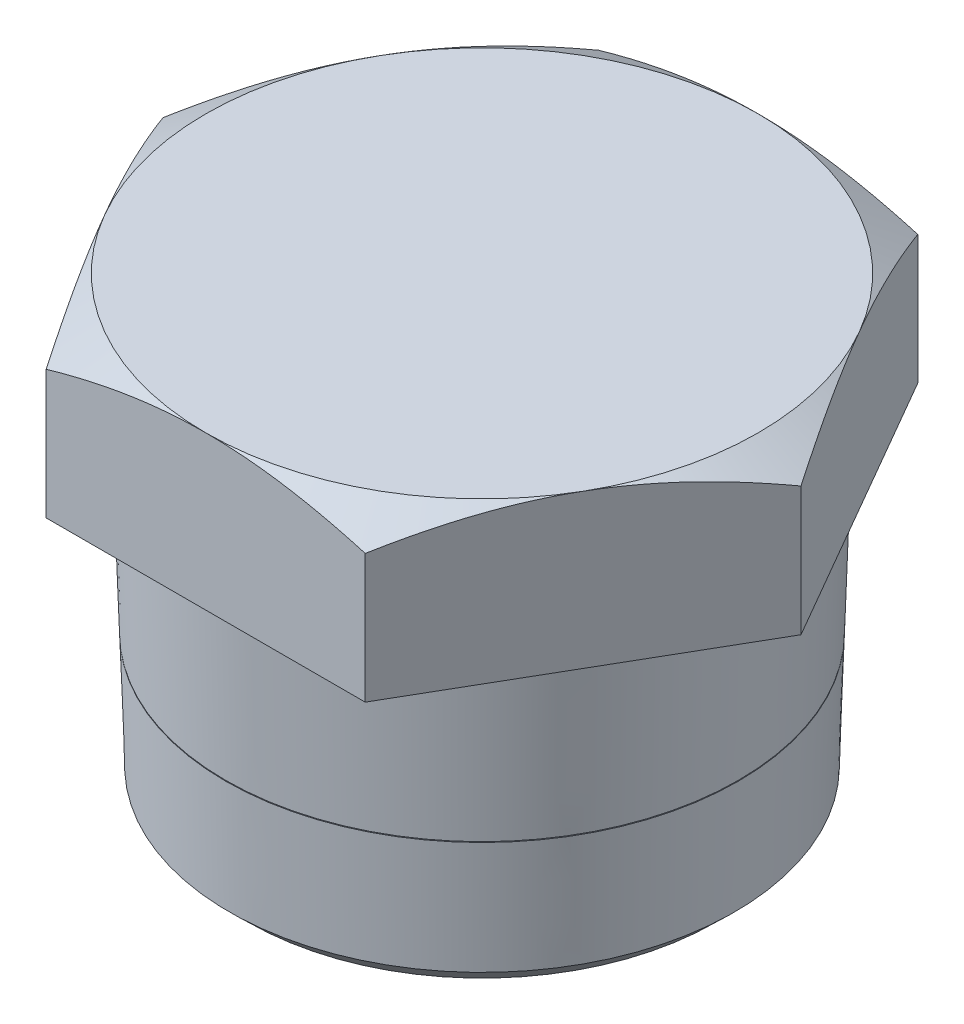
ISO-10303-21;
HEADER;
FILE_DESCRIPTION(('STEP AP214'),'2;1');
FILE_NAME('part.step','',(''),(''),'','','');
FILE_SCHEMA(('AUTOMOTIVE_DESIGN { 1 0 10303 214 1 1 1 1 }'));
ENDSEC;
DATA;
#1=APPLICATION_CONTEXT('core data for automotive mechanical design processes');
#2=APPLICATION_PROTOCOL_DEFINITION('international standard','automotive_design',2000,#1);
#3=PRODUCT_CONTEXT('',#1,'mechanical');
#4=PRODUCT('Part','Part','',(#3));
#5=PRODUCT_RELATED_PRODUCT_CATEGORY('part','',(#4));
#6=PRODUCT_DEFINITION_FORMATION('','',#4);
#7=PRODUCT_DEFINITION_CONTEXT('part definition',#1,'design');
#8=PRODUCT_DEFINITION('design','',#6,#7);
#9=PRODUCT_DEFINITION_SHAPE('','',#8);
#10=(LENGTH_UNIT() NAMED_UNIT(*) SI_UNIT(.MILLI.,.METRE.));
#11=(NAMED_UNIT(*) PLANE_ANGLE_UNIT() SI_UNIT($,.RADIAN.));
#12=(NAMED_UNIT(*) SI_UNIT($,.STERADIAN.) SOLID_ANGLE_UNIT());
#13=UNCERTAINTY_MEASURE_WITH_UNIT(LENGTH_MEASURE(1.E-05),#10,'distance_accuracy_value','');
#14=(GEOMETRIC_REPRESENTATION_CONTEXT(3) GLOBAL_UNCERTAINTY_ASSIGNED_CONTEXT((#13)) GLOBAL_UNIT_ASSIGNED_CONTEXT((#10,
#11,#12)) REPRESENTATION_CONTEXT('',''));
#15=CARTESIAN_POINT('',(0.,0.,0.));
#16=DIRECTION('',(0.,0.,1.));
#17=DIRECTION('',(1.,0.,0.));
#18=AXIS2_PLACEMENT_3D('',#15,#16,#17);
#19=CARTESIAN_POINT('',(0.,8.38919274896095,0.));
#20=DIRECTION('',(0.,-1.,0.));
#21=DIRECTION('',(0.,0.,-1.));
#22=AXIS2_PLACEMENT_3D('',#19,#20,#21);
#23=CONICAL_SURFACE('',#22,20.79,1.0471975511966);
#24=CARTESIAN_POINT('',(0.,10.,0.));
#25=DIRECTION('',(0.,-1.,0.));
#26=DIRECTION('',(0.,0.,-1.));
#27=AXIS2_PLACEMENT_3D('',#24,#25,#26);
#28=CIRCLE('',#27,18.);
#29=CARTESIAN_POINT('',(15.5884572681199,10.,-9.));
#30=VERTEX_POINT('',#29);
#31=CARTESIAN_POINT('',(15.5884572681199,10.,9.));
#32=VERTEX_POINT('',#31);
#33=EDGE_CURVE('E248',#30,#32,#28,.T.);
#34=ORIENTED_EDGE('',*,*,#33,.T.);
#35=CARTESIAN_POINT('',(10.3923036907127,8.39230417874654,18.000002));
#36=CARTESIAN_POINT('',(10.6207213092251,8.52416990531842,17.6043710793927));
#37=CARTESIAN_POINT('',(10.8500298784013,8.65005158318754,17.2071969869686));
#38=CARTESIAN_POINT('',(11.3104857871325,8.88818352120919,16.4096639584007));
#39=CARTESIAN_POINT('',(11.5416337049718,9.00042929803447,16.0093040206394));
#40=CARTESIAN_POINT('',(12.0062150050465,9.20978057800742,15.2046256046637));
#41=CARTESIAN_POINT('',(12.2396524525244,9.30685025984467,14.8003000852426));
#42=CARTESIAN_POINT('',(12.70814936062,9.48376493806821,13.9888396372322));
#43=CARTESIAN_POINT('',(12.9432087275495,9.56361092090378,13.5817048709152));
#44=CARTESIAN_POINT('',(13.4089265715698,9.7026821530429,12.7750579030806));
#45=CARTESIAN_POINT('',(13.6395504758277,9.76236771446473,12.3756055834662));
#46=CARTESIAN_POINT('',(14.1018549809195,9.86244605309504,11.5748706920792));
#47=CARTESIAN_POINT('',(14.3335356020085,9.90283845891142,11.1735880852239));
#48=CARTESIAN_POINT('',(14.7972859753715,9.9633106043179,10.3703488765302));
#49=CARTESIAN_POINT('',(15.029354935494,9.98341448032252,9.96839364673834));
#50=CARTESIAN_POINT('',(15.4937069998071,10.0028772264915,9.16411227874859));
#51=CARTESIAN_POINT('',(15.7259900971578,10.0022367377687,8.76178615239763));
#52=CARTESIAN_POINT('',(16.1602412290879,9.98166030105865,8.00964112865039));
#53=CARTESIAN_POINT('',(16.3622402189068,9.9642334647632,7.65976861520657));
#54=CARTESIAN_POINT('',(16.7657563433001,9.91402245272442,6.96085818608392));
#55=CARTESIAN_POINT('',(16.9672734847368,9.88123849701044,6.61182025851956));
#56=CARTESIAN_POINT('',(17.3697495660109,9.80088205841273,5.91471123692161));
#57=CARTESIAN_POINT('',(17.5707078347023,9.75329620398764,5.56664130534709));
#58=CARTESIAN_POINT('',(17.9716677608277,9.64417559945913,4.87215834149869));
#59=CARTESIAN_POINT('',(18.1716694223098,9.58264090843477,4.52574530221355));
#60=CARTESIAN_POINT('',(18.7787998249196,9.37554862611313,3.47416459807364));
#61=CARTESIAN_POINT('',(19.1841704624113,9.20934206451339,2.77204205804138));
#62=CARTESIAN_POINT('',(19.9888675791619,8.83212237906111,1.37826576712528));
#63=CARTESIAN_POINT('',(20.3882043591908,8.6211978318564,0.686594174784224));
#64=CARTESIAN_POINT('',(20.784610845527,8.39230417874654,-1.99999999899727E-06));
#65=B_SPLINE_CURVE_WITH_KNOTS('',3,(#35,#36,#37,#38,#39,#40,#41,#42,#43,#44,#45,#46,#47,#48,#49,
#50,#51,#52,#53,#54,#55,#56,#57,#58,#59,#60,#61,#62,#63,#64),.UNSPECIFIED.,.F.,.F.,(4,2,2,2,2,2,
2,2,2,2,2,2,2,2,4),(0.,1.42649553586316,2.85345882489467,4.28374102583886,5.71394128876975,
7.1088419116791,8.50376938526055,9.89703540880222,11.290258372938,12.5030869860494,
13.7158982228735,14.9298082704652,16.1437131767438,18.6249911150355,21.1013993466681),.UNSPECIFIED.);
#66=CARTESIAN_POINT('',(20.7846096908266,8.39230484541327,0.));
#67=VERTEX_POINT('',#66);
#68=EDGE_CURVE('E54',#32,#67,#65,.T.);
#69=ORIENTED_EDGE('',*,*,#68,.T.);
#70=CARTESIAN_POINT('',(20.784610845527,8.39230417874654,2.00000000181156E-06));
#71=CARTESIAN_POINT('',(20.5561932270147,8.52416990531841,-0.39562892060731));
#72=CARTESIAN_POINT('',(20.3268846578385,8.65005158318753,-0.792803013031403));
#73=CARTESIAN_POINT('',(19.8664287491073,8.88818352120917,-1.59033604159927));
#74=CARTESIAN_POINT('',(19.635280831268,9.00042929803445,-1.9906959793606));
#75=CARTESIAN_POINT('',(19.1706995311933,9.2097805780074,-2.79537439533634));
#76=CARTESIAN_POINT('',(18.9372620837153,9.30685025984465,-3.1996999147574));
#77=CARTESIAN_POINT('',(18.4687651756198,9.48376493806819,-4.01116036276782));
#78=CARTESIAN_POINT('',(18.2337058086902,9.56361092090376,-4.41829512908478));
#79=CARTESIAN_POINT('',(17.7679879646699,9.70268215304288,-5.22494209691939));
#80=CARTESIAN_POINT('',(17.5373640604121,9.7623677144647,-5.62439441653383));
#81=CARTESIAN_POINT('',(17.0750595553203,9.86244605309501,-6.42512930792079));
#82=CARTESIAN_POINT('',(16.8433789342313,9.9028384589114,-6.82641191477612));
#83=CARTESIAN_POINT('',(16.3796285608683,9.96331060431787,-7.62965112346985));
#84=CARTESIAN_POINT('',(16.1475596007458,9.98341448032249,-8.03160635326166));
#85=CARTESIAN_POINT('',(15.6832075364327,10.0028772264915,-8.83588772125142));
#86=CARTESIAN_POINT('',(15.450924439082,10.0022367377687,-9.23821384760238));
#87=CARTESIAN_POINT('',(15.0166733071519,9.98166030105865,-9.99035887134962));
#88=CARTESIAN_POINT('',(14.814674317333,9.96423346476318,-10.3402313847934));
#89=CARTESIAN_POINT('',(14.4111581929397,9.91402245272438,-11.0391418139161));
#90=CARTESIAN_POINT('',(14.209641051503,9.88123849701041,-11.3881797414804));
#91=CARTESIAN_POINT('',(13.8071649702289,9.80088205841271,-12.0852887630784));
#92=CARTESIAN_POINT('',(13.6062067015375,9.75329620398762,-12.4333586946529));
#93=CARTESIAN_POINT('',(13.205246775412,9.6441755994591,-13.1278416585013));
#94=CARTESIAN_POINT('',(13.00524511393,9.58264090843474,-13.4742546977865));
#95=CARTESIAN_POINT('',(12.3981147113202,9.3755486261131,-14.5258354019264));
#96=CARTESIAN_POINT('',(11.9927440738284,9.20934206451337,-15.2279579419586));
#97=CARTESIAN_POINT('',(11.1880469570779,8.83212237906109,-16.6217342328747));
#98=CARTESIAN_POINT('',(10.788710177049,8.62119783185639,-17.3134058252158));
#99=CARTESIAN_POINT('',(10.3923036907127,8.39230417874654,-18.000002));
#100=B_SPLINE_CURVE_WITH_KNOTS('',3,(#70,#71,#72,#73,#74,#75,#76,#77,#78,#79,#80,#81,#82,#83,
#84,#85,#86,#87,#88,#89,#90,#91,#92,#93,#94,#95,#96,#97,#98,#99),.UNSPECIFIED.,.F.,.F.,(4,2,2,2,
2,2,2,2,2,2,2,2,2,2,4),(0.,1.42649553586316,2.85345882489466,4.28374102583885,5.71394128876974,
7.10884191167909,8.50376938526053,9.89703540880221,11.290258372938,12.5030869860494,
13.7158982228735,14.9298082704651,16.1437131767437,18.6249911150355,21.1013993466681),.UNSPECIFIED.);
#101=EDGE_CURVE('E203',#67,#30,#100,.T.);
#102=ORIENTED_EDGE('',*,*,#101,.T.);
#103=EDGE_LOOP('',(#34,#69,#102));
#104=FACE_BOUND('',#103,.T.);
#105=ADVANCED_FACE('F39',(#104),#23,.T.);
#106=CARTESIAN_POINT('',(0.,10.,18.));
#107=VERTEX_POINT('',#106);
#108=CARTESIAN_POINT('',(-15.5884572681199,10.,9.));
#109=VERTEX_POINT('',#108);
#110=EDGE_CURVE('E267',#107,#109,#28,.T.);
#111=ORIENTED_EDGE('',*,*,#110,.T.);
#112=CARTESIAN_POINT('',(-20.784610845527,8.39230417874654,-2.00000000811871E-06));
#113=CARTESIAN_POINT('',(-20.5561932270147,8.52416990531841,0.395628920607305));
#114=CARTESIAN_POINT('',(-20.3268846578385,8.65005158318753,0.792803013031398));
#115=CARTESIAN_POINT('',(-19.8664287491073,8.88818352120917,1.59033604159926));
#116=CARTESIAN_POINT('',(-19.635280831268,9.00042929803445,1.9906959793606));
#117=CARTESIAN_POINT('',(-19.1706995311933,9.2097805780074,2.79537439533634));
#118=CARTESIAN_POINT('',(-18.9372620837153,9.30685025984465,3.1996999147574));
#119=CARTESIAN_POINT('',(-18.4687651756198,9.48376493806819,4.01116036276782));
#120=CARTESIAN_POINT('',(-18.2337058086902,9.56361092090376,4.41829512908478));
#121=CARTESIAN_POINT('',(-17.7679879646699,9.70268215304288,5.22494209691938));
#122=CARTESIAN_POINT('',(-17.5373640604121,9.7623677144647,5.62439441653383));
#123=CARTESIAN_POINT('',(-17.0750595553203,9.86244605309501,6.42512930792079));
#124=CARTESIAN_POINT('',(-16.8433789342313,9.9028384589114,6.82641191477612));
#125=CARTESIAN_POINT('',(-16.3796285608683,9.96331060431788,7.62965112346985));
#126=CARTESIAN_POINT('',(-16.1475596007458,9.98341448032249,8.03160635326166));
#127=CARTESIAN_POINT('',(-15.6832075364327,10.0028772264915,8.83588772125142));
#128=CARTESIAN_POINT('',(-15.450924439082,10.0022367377687,9.23821384760238));
#129=CARTESIAN_POINT('',(-15.0166733071519,9.98166030105865,9.99035887134961));
#130=CARTESIAN_POINT('',(-14.814674317333,9.96423346476318,10.3402313847934));
#131=CARTESIAN_POINT('',(-14.4111581929397,9.91402245272438,11.0391418139161));
#132=CARTESIAN_POINT('',(-14.209641051503,9.88123849701041,11.3881797414804));
#133=CARTESIAN_POINT('',(-13.8071649702289,9.80088205841271,12.0852887630784));
#134=CARTESIAN_POINT('',(-13.6062067015375,9.75329620398762,12.4333586946529));
#135=CARTESIAN_POINT('',(-13.205246775412,9.6441755994591,13.1278416585013));
#136=CARTESIAN_POINT('',(-13.00524511393,9.58264090843474,13.4742546977864));
#137=CARTESIAN_POINT('',(-12.3981147113202,9.3755486261131,14.5258354019264));
#138=CARTESIAN_POINT('',(-11.9927440738284,9.20934206451337,15.2279579419586));
#139=CARTESIAN_POINT('',(-11.1880469570779,8.83212237906109,16.6217342328747));
#140=CARTESIAN_POINT('',(-10.788710177049,8.62119783185639,17.3134058252158));
#141=CARTESIAN_POINT('',(-10.3923036907127,8.39230417874654,18.000002));
#142=B_SPLINE_CURVE_WITH_KNOTS('',3,(#112,#113,#114,#115,#116,#117,#118,#119,#120,#121,#122,
#123,#124,#125,#126,#127,#128,#129,#130,#131,#132,#133,#134,#135,#136,#137,#138,#139,#140,#141),
.UNSPECIFIED.,.F.,.F.,(4,2,2,2,2,2,2,2,2,2,2,2,2,2,4),(0.,1.42649553586316,2.85345882489467,
4.28374102583885,5.71394128876974,7.10884191167909,8.50376938526054,9.89703540880221,
11.290258372938,12.5030869860494,13.7158982228735,14.9298082704651,16.1437131767437,
18.6249911150355,21.1013993466681),.UNSPECIFIED.);
#143=CARTESIAN_POINT('',(-10.3923048454133,8.39230484541327,18.));
#144=VERTEX_POINT('',#143);
#145=EDGE_CURVE('E172',#109,#144,#142,.T.);
#146=ORIENTED_EDGE('',*,*,#145,.T.);
#147=CARTESIAN_POINT('',(-27.5623556097859,1.38631064393132,18.));
#148=CARTESIAN_POINT('',(-27.1672177056184,1.57731534165986,18.));
#149=CARTESIAN_POINT('',(-26.771602209626,1.76733154051287,18.));
#150=CARTESIAN_POINT('',(-25.9793151355648,2.14516004481674,18.));
#151=CARTESIAN_POINT('',(-25.5826435459512,2.332972326053,18.));
#152=CARTESIAN_POINT('',(-24.3907771493102,2.89281735172718,18.));
#153=CARTESIAN_POINT('',(-23.5938591304301,3.26119602405599,18.));
#154=CARTESIAN_POINT('',(-21.9899562643407,3.98793883307851,18.));
#155=CARTESIAN_POINT('',(-21.1829399065641,4.34623360097959,18.));
#156=CARTESIAN_POINT('',(-19.5622752124073,5.0474402693107,18.));
#157=CARTESIAN_POINT('',(-18.7486272240458,5.39035297090597,18.));
#158=CARTESIAN_POINT('',(-17.103302750893,6.0607671714632,18.));
#159=CARTESIAN_POINT('',(-16.2715275718312,6.38802772418407,18.));
#160=CARTESIAN_POINT('',(-14.5981607876184,7.01692005386219,18.));
#161=CARTESIAN_POINT('',(-13.7565681032243,7.31854898234519,18.));
#162=CARTESIAN_POINT('',(-12.0639835114708,7.88806962355789,18.));
#163=CARTESIAN_POINT('',(-11.2130159374681,8.15603306126355,18.));
#164=CARTESIAN_POINT('',(-9.49890089184789,8.64953370810458,18.));
#165=CARTESIAN_POINT('',(-8.63575736086552,8.87508431980805,18.));
#166=CARTESIAN_POINT('',(-7.33174610522679,9.17334404428129,18.));
#167=CARTESIAN_POINT('',(-6.89543387773761,9.26610150238116,18.));
#168=CARTESIAN_POINT('',(-6.01990543361556,9.43679637733826,18.));
#169=CARTESIAN_POINT('',(-5.58068928242436,9.51473412699645,18.));
#170=CARTESIAN_POINT('',(-4.69964773722797,9.65440788458735,18.));
#171=CARTESIAN_POINT('',(-4.25782218468983,9.71614289755803,18.));
#172=CARTESIAN_POINT('',(-3.37206807457236,9.82217123091665,18.));
#173=CARTESIAN_POINT('',(-2.92813951449539,9.86646453058463,18.));
#174=CARTESIAN_POINT('',(-2.0416451699526,9.93641698541635,18.));
#175=CARTESIAN_POINT('',(-1.59908864716483,9.96219274473886,18.));
#176=CARTESIAN_POINT('',(-0.713283173132433,9.99497460483232,18.));
#177=CARTESIAN_POINT('',(-0.270034232451787,10.0019809892163,18.));
#178=CARTESIAN_POINT('',(0.616237906136606,9.99705792959304,18.));
#179=CARTESIAN_POINT('',(1.05926113257133,9.98513372423586,18.));
#180=CARTESIAN_POINT('',(1.94441482260883,9.94264599626146,18.));
#181=CARTESIAN_POINT('',(2.38654524605246,9.91208165313946,18.));
#182=CARTESIAN_POINT('',(3.4577958532977,9.81608123254612,18.));
#183=CARTESIAN_POINT('',(4.08609712631257,9.74132537780645,18.));
#184=CARTESIAN_POINT('',(5.33777794205602,9.55833282620481,18.));
#185=CARTESIAN_POINT('',(5.96115674059623,9.45009116264969,18.));
#186=CARTESIAN_POINT('',(7.82499681699079,9.08056649286296,18.));
#187=CARTESIAN_POINT('',(9.05672705342509,8.77472978846706,18.));
#188=CARTESIAN_POINT('',(10.8991905471785,8.24736233028802,18.));
#189=CARTESIAN_POINT('',(11.5195501421751,8.05755699149823,18.));
#190=CARTESIAN_POINT('',(12.7542760400307,7.6590210154475,18.));
#191=CARTESIAN_POINT('',(13.3686417962929,7.45028866971574,18.));
#192=CARTESIAN_POINT('',(14.5883176550919,7.01834631048448,18.));
#193=CARTESIAN_POINT('',(15.193659287337,6.79522457924596,18.));
#194=CARTESIAN_POINT('',(16.097859208457,6.45088130373047,18.));
#195=CARTESIAN_POINT('',(16.3985751697836,6.33450980752117,18.));
#196=CARTESIAN_POINT('',(16.9988388768481,6.09880793743563,18.));
#197=CARTESIAN_POINT('',(17.2983866456109,5.97947762222193,18.));
#198=CARTESIAN_POINT('',(17.5973908529753,5.85880142707694,18.));
#199=B_SPLINE_CURVE_WITH_KNOTS('',3,(#147,#148,#149,#150,#151,#152,#153,#154,#155,#156,#157,
#158,#159,#160,#161,#162,#163,#164,#165,#166,#167,#168,#169,#170,#171,#172,#173,#174,#175,#176,
#177,#178,#179,#180,#181,#182,#183,#184,#185,#186,#187,#188,#189,#190,#191,#192,#193,#194,#195,
#196,#197,#198),.UNSPECIFIED.,.F.,.F.,(4,2,2,2,2,2,2,2,2,2,2,2,2,2,2,2,2,2,2,2,2,2,2,2,2,4),(0.,
1.31664120790822,2.63329686833336,5.26703629410476,7.91584679658207,10.5645191768606,
13.2457156965256,15.9272097922792,18.6028903744577,21.2777240081671,22.6157021651747,
23.9536502721295,25.2916805192985,26.6297123559818,27.959242999422,29.2887535529875,
30.617896256065,31.9470974697976,33.844218469182,35.7416209889912,39.5437347154747,
41.4898216566064,43.4360844390053,45.3713716264579,46.3387006666734,47.3060105436121),.UNSPECIFIED.);
#200=EDGE_CURVE('E135',#144,#107,#199,.T.);
#201=ORIENTED_EDGE('',*,*,#200,.T.);
#202=EDGE_LOOP('',(#111,#146,#201));
#203=FACE_BOUND('',#202,.T.);
#204=ADVANCED_FACE('F164',(#203),#23,.T.);
#205=CARTESIAN_POINT('',(-15.5884572681199,10.,-9.));
#206=VERTEX_POINT('',#205);
#207=EDGE_CURVE('E258',#109,#206,#28,.T.);
#208=ORIENTED_EDGE('',*,*,#207,.T.);
#209=CARTESIAN_POINT('',(-10.3923036907127,8.39230417874654,-18.000002));
#210=CARTESIAN_POINT('',(-10.6207213092251,8.52416990531841,-17.6043710793927));
#211=CARTESIAN_POINT('',(-10.8500298784013,8.65005158318754,-17.2071969869686));
#212=CARTESIAN_POINT('',(-11.3104857871326,8.88818352120918,-16.4096639584007));
#213=CARTESIAN_POINT('',(-11.5416337049718,9.00042929803446,-16.0093040206394));
#214=CARTESIAN_POINT('',(-12.0062150050465,9.20978057800741,-15.2046256046637));
#215=CARTESIAN_POINT('',(-12.2396524525245,9.30685025984467,-14.8003000852426));
#216=CARTESIAN_POINT('',(-12.70814936062,9.4837649380682,-13.9888396372322));
#217=CARTESIAN_POINT('',(-12.9432087275496,9.56361092090377,-13.5817048709152));
#218=CARTESIAN_POINT('',(-13.4089265715699,9.70268215304289,-12.7750579030806));
#219=CARTESIAN_POINT('',(-13.6395504758277,9.76236771446472,-12.3756055834662));
#220=CARTESIAN_POINT('',(-14.1018549809195,9.86244605309503,-11.5748706920792));
#221=CARTESIAN_POINT('',(-14.3335356020085,9.90283845891141,-11.1735880852239));
#222=CARTESIAN_POINT('',(-14.7972859753715,9.96331060431789,-10.3703488765302));
#223=CARTESIAN_POINT('',(-15.029354935494,9.98341448032251,-9.96839364673835));
#224=CARTESIAN_POINT('',(-15.4937069998071,10.0028772264915,-9.16411227874859));
#225=CARTESIAN_POINT('',(-15.7259900971578,10.0022367377687,-8.76178615239763));
#226=CARTESIAN_POINT('',(-16.1602412290879,9.98166030105865,-8.0096411286504));
#227=CARTESIAN_POINT('',(-16.3622402189068,9.96423346476319,-7.65976861520658));
#228=CARTESIAN_POINT('',(-16.7657563433001,9.9140224527244,-6.96085818608393));
#229=CARTESIAN_POINT('',(-16.9672734847368,9.88123849701043,-6.61182025851957));
#230=CARTESIAN_POINT('',(-17.3697495660109,9.80088205841272,-5.91471123692162));
#231=CARTESIAN_POINT('',(-17.5707078347023,9.75329620398763,-5.5666413053471));
#232=CARTESIAN_POINT('',(-17.9716677608278,9.64417559945912,-4.8721583414987));
#233=CARTESIAN_POINT('',(-18.1716694223098,9.58264090843476,-4.52574530221356));
#234=CARTESIAN_POINT('',(-18.7787998249196,9.37554862611312,-3.47416459807365));
#235=CARTESIAN_POINT('',(-19.1841704624114,9.20934206451339,-2.77204205804139));
#236=CARTESIAN_POINT('',(-19.9888675791619,8.83212237906111,-1.3782657671253));
#237=CARTESIAN_POINT('',(-20.3882043591908,8.6211978318564,-0.686594174784236));
#238=CARTESIAN_POINT('',(-20.784610845527,8.39230417874654,1.99999999224221E-06));
#239=B_SPLINE_CURVE_WITH_KNOTS('',3,(#209,#210,#211,#212,#213,#214,#215,#216,#217,#218,#219,
#220,#221,#222,#223,#224,#225,#226,#227,#228,#229,#230,#231,#232,#233,#234,#235,#236,#237,#238),
.UNSPECIFIED.,.F.,.F.,(4,2,2,2,2,2,2,2,2,2,2,2,2,2,4),(0.,1.42649553586316,2.85345882489467,
4.28374102583885,5.71394128876974,7.1088419116791,8.50376938526054,9.89703540880222,
11.290258372938,12.5030869860494,13.7158982228735,14.9298082704652,16.1437131767438,
18.6249911150355,21.1013993466681),.UNSPECIFIED.);
#240=CARTESIAN_POINT('',(-20.7846096908266,8.39230484541327,0.));
#241=VERTEX_POINT('',#240);
#242=EDGE_CURVE('E181',#206,#241,#239,.T.);
#243=ORIENTED_EDGE('',*,*,#242,.T.);
#244=EDGE_CURVE('E255',#241,#109,#142,.T.);
#245=ORIENTED_EDGE('',*,*,#244,.T.);
#246=EDGE_LOOP('',(#208,#243,#245));
#247=FACE_BOUND('',#246,.T.);
#248=ADVANCED_FACE('F228',(#247),#23,.T.);
#249=CARTESIAN_POINT('',(0.,10.,-18.));
#250=VERTEX_POINT('',#249);
#251=EDGE_CURVE('E249',#206,#250,#28,.T.);
#252=ORIENTED_EDGE('',*,*,#251,.T.);
#253=CARTESIAN_POINT('',(-27.5623556097859,1.38631064393132,-18.));
#254=CARTESIAN_POINT('',(-27.1672177056184,1.57731534165987,-18.));
#255=CARTESIAN_POINT('',(-26.771602209626,1.76733154051288,-18.));
#256=CARTESIAN_POINT('',(-25.9793151355647,2.14516004481676,-18.));
#257=CARTESIAN_POINT('',(-25.5826435459511,2.33297232605301,-18.));
#258=CARTESIAN_POINT('',(-24.3907771493102,2.89281735172719,-18.));
#259=CARTESIAN_POINT('',(-23.5938591304301,3.261196024056,-18.));
#260=CARTESIAN_POINT('',(-21.9899562643406,3.98793883307852,-18.));
#261=CARTESIAN_POINT('',(-21.1829399065641,4.3462336009796,-18.));
#262=CARTESIAN_POINT('',(-19.5622752124073,5.04744026931071,-18.));
#263=CARTESIAN_POINT('',(-18.7486272240458,5.39035297090598,-18.));
#264=CARTESIAN_POINT('',(-17.103302750893,6.06076717146321,-18.));
#265=CARTESIAN_POINT('',(-16.2715275718312,6.38802772418408,-18.));
#266=CARTESIAN_POINT('',(-14.5981607876184,7.0169200538622,-18.));
#267=CARTESIAN_POINT('',(-13.7565681032243,7.31854898234519,-18.));
#268=CARTESIAN_POINT('',(-12.0639835114707,7.88806962355789,-18.));
#269=CARTESIAN_POINT('',(-11.2130159374681,8.15603306126355,-18.));
#270=CARTESIAN_POINT('',(-9.49890089184787,8.64953370810458,-18.));
#271=CARTESIAN_POINT('',(-8.63575736086551,8.87508431980805,-18.));
#272=CARTESIAN_POINT('',(-7.33174610522678,9.17334404428129,-18.));
#273=CARTESIAN_POINT('',(-6.8954338777376,9.26610150238116,-18.));
#274=CARTESIAN_POINT('',(-6.01990543361555,9.43679637733826,-18.));
#275=CARTESIAN_POINT('',(-5.58068928242435,9.51473412699645,-18.));
#276=CARTESIAN_POINT('',(-4.69964773722796,9.65440788458734,-18.));
#277=CARTESIAN_POINT('',(-4.25782218468982,9.71614289755803,-18.));
#278=CARTESIAN_POINT('',(-3.37206807457235,9.82217123091665,-18.));
#279=CARTESIAN_POINT('',(-2.92813951449538,9.86646453058463,-18.));
#280=CARTESIAN_POINT('',(-2.04164516995259,9.93641698541635,-18.));
#281=CARTESIAN_POINT('',(-1.59908864716482,9.96219274473886,-18.));
#282=CARTESIAN_POINT('',(-0.713283173132425,9.99497460483232,-18.));
#283=CARTESIAN_POINT('',(-0.270034232451778,10.0019809892163,-18.));
#284=CARTESIAN_POINT('',(0.616237906136615,9.99705792959304,-18.));
#285=CARTESIAN_POINT('',(1.05926113257134,9.98513372423586,-18.));
#286=CARTESIAN_POINT('',(1.94441482260884,9.94264599626147,-18.));
#287=CARTESIAN_POINT('',(2.38654524605247,9.91208165313946,-18.));
#288=CARTESIAN_POINT('',(3.45779585329771,9.81608123254612,-18.));
#289=CARTESIAN_POINT('',(4.08609712631258,9.74132537780645,-18.));
#290=CARTESIAN_POINT('',(5.33777794205603,9.55833282620482,-18.));
#291=CARTESIAN_POINT('',(5.96115674059624,9.45009116264969,-18.));
#292=CARTESIAN_POINT('',(7.8249968169908,9.08056649286297,-18.));
#293=CARTESIAN_POINT('',(9.0567270534251,8.77472978846706,-18.));
#294=CARTESIAN_POINT('',(10.8991905471785,8.24736233028802,-18.));
#295=CARTESIAN_POINT('',(11.5195501421752,8.05755699149823,-18.));
#296=CARTESIAN_POINT('',(12.7542760400307,7.65902101544751,-18.));
#297=CARTESIAN_POINT('',(13.3686417962929,7.45028866971574,-18.));
#298=CARTESIAN_POINT('',(14.5883176550919,7.01834631048449,-18.));
#299=CARTESIAN_POINT('',(15.193659287337,6.79522457924597,-18.));
#300=CARTESIAN_POINT('',(16.097859208457,6.45088130373048,-18.));
#301=CARTESIAN_POINT('',(16.3985751697836,6.33450980752118,-18.));
#302=CARTESIAN_POINT('',(16.9988388768481,6.09880793743564,-18.));
#303=CARTESIAN_POINT('',(17.2983866456109,5.97947762222193,-18.));
#304=CARTESIAN_POINT('',(17.5973908529753,5.85880142707694,-18.));
#305=B_SPLINE_CURVE_WITH_KNOTS('',3,(#253,#254,#255,#256,#257,#258,#259,#260,#261,#262,#263,
#264,#265,#266,#267,#268,#269,#270,#271,#272,#273,#274,#275,#276,#277,#278,#279,#280,#281,#282,
#283,#284,#285,#286,#287,#288,#289,#290,#291,#292,#293,#294,#295,#296,#297,#298,#299,#300,#301,
#302,#303,#304),.UNSPECIFIED.,.F.,.F.,(4,2,2,2,2,2,2,2,2,2,2,2,2,2,2,2,2,2,2,2,2,2,2,2,2,4),(0.,
1.31664120790821,2.63329686833336,5.26703629410476,7.91584679658207,10.5645191768606,
13.2457156965256,15.9272097922792,18.6028903744576,21.2777240081671,22.6157021651747,
23.9536502721294,25.2916805192985,26.6297123559818,27.959242999422,29.2887535529875,
30.6178962560649,31.9470974697976,33.844218469182,35.7416209889911,39.5437347154747,
41.4898216566064,43.4360844390052,45.3713716264579,46.3387006666734,47.3060105436121),.UNSPECIFIED.);
#306=CARTESIAN_POINT('',(-10.3923048454133,8.39230484541327,-18.));
#307=VERTEX_POINT('',#306);
#308=EDGE_CURVE('E189',#250,#307,#305,.F.);
#309=ORIENTED_EDGE('',*,*,#308,.T.);
#310=EDGE_CURVE('E597',#307,#206,#239,.T.);
#311=ORIENTED_EDGE('',*,*,#310,.T.);
#312=EDGE_LOOP('',(#252,#309,#311));
#313=FACE_BOUND('',#312,.T.);
#314=ADVANCED_FACE('F232',(#313),#23,.T.);
#315=EDGE_CURVE('E243',#250,#30,#28,.T.);
#316=ORIENTED_EDGE('',*,*,#315,.T.);
#317=CARTESIAN_POINT('',(10.3923048454133,8.39230484541327,-18.));
#318=VERTEX_POINT('',#317);
#319=EDGE_CURVE('E62',#30,#318,#100,.T.);
#320=ORIENTED_EDGE('',*,*,#319,.T.);
#321=EDGE_CURVE('E204',#318,#250,#305,.F.);
#322=ORIENTED_EDGE('',*,*,#321,.T.);
#323=EDGE_LOOP('',(#316,#320,#322));
#324=FACE_BOUND('',#323,.T.);
#325=ADVANCED_FACE('F224',(#324),#23,.T.);
#326=CARTESIAN_POINT('',(18.,10.,0.));
#327=DIRECTION('',(0.,1.,0.));
#328=DIRECTION('',(0.,0.,1.));
#329=AXIS2_PLACEMENT_3D('',#326,#327,#328);
#330=PLANE('',#329);
#331=ORIENTED_EDGE('',*,*,#315,.F.);
#332=ORIENTED_EDGE('',*,*,#251,.F.);
#333=ORIENTED_EDGE('',*,*,#207,.F.);
#334=ORIENTED_EDGE('',*,*,#110,.F.);
#335=EDGE_CURVE('E133',#32,#107,#28,.T.);
#336=ORIENTED_EDGE('',*,*,#335,.F.);
#337=ORIENTED_EDGE('',*,*,#33,.F.);
#338=EDGE_LOOP('',(#331,#332,#333,#334,#336,#337));
#339=FACE_BOUND('',#338,.T.);
#340=ADVANCED_FACE('F163',(#339),#330,.T.);
#341=CARTESIAN_POINT('',(10.3923048454132,8.39230484541327,18.));
#342=VERTEX_POINT('',#341);
#343=EDGE_CURVE('E115',#107,#342,#199,.T.);
#344=ORIENTED_EDGE('',*,*,#343,.T.);
#345=EDGE_CURVE('E124',#342,#32,#65,.T.);
#346=ORIENTED_EDGE('',*,*,#345,.T.);
#347=ORIENTED_EDGE('',*,*,#335,.T.);
#348=EDGE_LOOP('',(#344,#346,#347));
#349=FACE_BOUND('',#348,.T.);
#350=ADVANCED_FACE('F132',(#349),#23,.T.);
#351=CARTESIAN_POINT('',(10.3923048454132,11.,18.));
#352=DIRECTION('',(-0.866025403784439,0.,-0.5));
#353=DIRECTION('',(-0.5,0.,0.866025403784439));
#354=AXIS2_PLACEMENT_3D('',#351,#352,#353);
#355=PLANE('',#354);
#356=DIRECTION('',(-0.5,0.,0.866025403784439));
#357=VECTOR('',#356,1.);
#358=CARTESIAN_POINT('',(10.3923048454132,0.,18.));
#359=LINE('',#358,#357);
#360=CARTESIAN_POINT('',(20.7846096908266,0.,0.));
#361=VERTEX_POINT('',#360);
#362=CARTESIAN_POINT('',(10.3923048454132,0.,18.));
#363=VERTEX_POINT('',#362);
#364=EDGE_CURVE('E122',#361,#363,#359,.T.);
#365=ORIENTED_EDGE('',*,*,#364,.F.);
#366=DIRECTION('',(0.,-1.,0.));
#367=VECTOR('',#366,1.);
#368=CARTESIAN_POINT('',(20.7846096908266,11.,0.));
#369=LINE('',#368,#367);
#370=EDGE_CURVE('E136',#67,#361,#369,.T.);
#371=ORIENTED_EDGE('',*,*,#370,.F.);
#372=ORIENTED_EDGE('',*,*,#68,.F.);
#373=ORIENTED_EDGE('',*,*,#345,.F.);
#374=DIRECTION('',(0.,-1.,0.));
#375=VECTOR('',#374,1.);
#376=CARTESIAN_POINT('',(10.3923048454132,11.,18.));
#377=LINE('',#376,#375);
#378=EDGE_CURVE('E112',#342,#363,#377,.T.);
#379=ORIENTED_EDGE('',*,*,#378,.T.);
#380=EDGE_LOOP('',(#365,#371,#372,#373,#379));
#381=FACE_BOUND('',#380,.T.);
#382=ADVANCED_FACE('F125',(#381),#355,.F.);
#383=CARTESIAN_POINT('',(20.7846096908266,11.,0.));
#384=DIRECTION('',(-0.866025403784439,0.,0.5));
#385=DIRECTION('',(0.5,0.,0.866025403784439));
#386=AXIS2_PLACEMENT_3D('',#383,#384,#385);
#387=PLANE('',#386);
#388=DIRECTION('',(0.5,0.,0.866025403784439));
#389=VECTOR('',#388,1.);
#390=CARTESIAN_POINT('',(20.7846096908266,0.,0.));
#391=LINE('',#390,#389);
#392=CARTESIAN_POINT('',(10.3923048454133,0.,-18.));
#393=VERTEX_POINT('',#392);
#394=EDGE_CURVE('E667',#393,#361,#391,.T.);
#395=ORIENTED_EDGE('',*,*,#394,.F.);
#396=DIRECTION('',(0.,-1.,0.));
#397=VECTOR('',#396,1.);
#398=CARTESIAN_POINT('',(10.3923048454133,11.,-18.));
#399=LINE('',#398,#397);
#400=EDGE_CURVE('E143',#318,#393,#399,.T.);
#401=ORIENTED_EDGE('',*,*,#400,.F.);
#402=ORIENTED_EDGE('',*,*,#319,.F.);
#403=ORIENTED_EDGE('',*,*,#101,.F.);
#404=ORIENTED_EDGE('',*,*,#370,.T.);
#405=EDGE_LOOP('',(#395,#401,#402,#403,#404));
#406=FACE_BOUND('',#405,.T.);
#407=ADVANCED_FACE('F213',(#406),#387,.F.);
#408=CARTESIAN_POINT('',(10.3923048454133,11.,-18.));
#409=DIRECTION('',(0.,0.,1.));
#410=DIRECTION('',(1.,0.,0.));
#411=AXIS2_PLACEMENT_3D('',#408,#409,#410);
#412=PLANE('',#411);
#413=DIRECTION('',(1.,0.,0.));
#414=VECTOR('',#413,1.);
#415=CARTESIAN_POINT('',(10.3923048454133,0.,-18.));
#416=LINE('',#415,#414);
#417=CARTESIAN_POINT('',(-10.3923048454133,0.,-18.));
#418=VERTEX_POINT('',#417);
#419=EDGE_CURVE('E661',#418,#393,#416,.T.);
#420=ORIENTED_EDGE('',*,*,#419,.F.);
#421=DIRECTION('',(0.,-1.,0.));
#422=VECTOR('',#421,1.);
#423=CARTESIAN_POINT('',(-10.3923048454133,11.,-18.));
#424=LINE('',#423,#422);
#425=EDGE_CURVE('E690',#307,#418,#424,.T.);
#426=ORIENTED_EDGE('',*,*,#425,.F.);
#427=ORIENTED_EDGE('',*,*,#308,.F.);
#428=ORIENTED_EDGE('',*,*,#321,.F.);
#429=ORIENTED_EDGE('',*,*,#400,.T.);
#430=EDGE_LOOP('',(#420,#426,#427,#428,#429));
#431=FACE_BOUND('',#430,.T.);
#432=ADVANCED_FACE('F216',(#431),#412,.F.);
#433=CARTESIAN_POINT('',(-10.3923048454133,11.,-18.));
#434=DIRECTION('',(0.866025403784439,0.,0.5));
#435=DIRECTION('',(0.5,0.,-0.866025403784439));
#436=AXIS2_PLACEMENT_3D('',#433,#434,#435);
#437=PLANE('',#436);
#438=DIRECTION('',(0.5,0.,-0.866025403784439));
#439=VECTOR('',#438,1.);
#440=CARTESIAN_POINT('',(-10.3923048454133,0.,-18.));
#441=LINE('',#440,#439);
#442=CARTESIAN_POINT('',(-20.7846096908266,0.,0.));
#443=VERTEX_POINT('',#442);
#444=EDGE_CURVE('E656',#443,#418,#441,.T.);
#445=ORIENTED_EDGE('',*,*,#444,.F.);
#446=DIRECTION('',(0.,-1.,0.));
#447=VECTOR('',#446,1.);
#448=CARTESIAN_POINT('',(-20.7846096908266,11.,0.));
#449=LINE('',#448,#447);
#450=EDGE_CURVE('E684',#241,#443,#449,.T.);
#451=ORIENTED_EDGE('',*,*,#450,.F.);
#452=ORIENTED_EDGE('',*,*,#242,.F.);
#453=ORIENTED_EDGE('',*,*,#310,.F.);
#454=ORIENTED_EDGE('',*,*,#425,.T.);
#455=EDGE_LOOP('',(#445,#451,#452,#453,#454));
#456=FACE_BOUND('',#455,.T.);
#457=ADVANCED_FACE('F470',(#456),#437,.F.);
#458=CARTESIAN_POINT('',(-20.7846096908266,11.,0.));
#459=DIRECTION('',(0.866025403784439,0.,-0.5));
#460=DIRECTION('',(-0.5,0.,-0.866025403784439));
#461=AXIS2_PLACEMENT_3D('',#458,#459,#460);
#462=PLANE('',#461);
#463=DIRECTION('',(-0.5,0.,-0.866025403784439));
#464=VECTOR('',#463,1.);
#465=CARTESIAN_POINT('',(-20.7846096908266,0.,0.));
#466=LINE('',#465,#464);
#467=CARTESIAN_POINT('',(-10.3923048454133,0.,18.));
#468=VERTEX_POINT('',#467);
#469=EDGE_CURVE('E130',#468,#443,#466,.T.);
#470=ORIENTED_EDGE('',*,*,#469,.F.);
#471=DIRECTION('',(0.,-1.,0.));
#472=VECTOR('',#471,1.);
#473=CARTESIAN_POINT('',(-10.3923048454133,11.,18.));
#474=LINE('',#473,#472);
#475=EDGE_CURVE('E121',#144,#468,#474,.T.);
#476=ORIENTED_EDGE('',*,*,#475,.F.);
#477=ORIENTED_EDGE('',*,*,#145,.F.);
#478=ORIENTED_EDGE('',*,*,#244,.F.);
#479=ORIENTED_EDGE('',*,*,#450,.T.);
#480=EDGE_LOOP('',(#470,#476,#477,#478,#479));
#481=FACE_BOUND('',#480,.T.);
#482=ADVANCED_FACE('F461',(#481),#462,.F.);
#483=CARTESIAN_POINT('',(-10.3923048454133,11.,18.));
#484=DIRECTION('',(0.,0.,-1.));
#485=DIRECTION('',(-1.,0.,0.));
#486=AXIS2_PLACEMENT_3D('',#483,#484,#485);
#487=PLANE('',#486);
#488=DIRECTION('',(-1.,0.,0.));
#489=VECTOR('',#488,1.);
#490=CARTESIAN_POINT('',(-10.3923048454133,0.,18.));
#491=LINE('',#490,#489);
#492=EDGE_CURVE('E118',#363,#468,#491,.T.);
#493=ORIENTED_EDGE('',*,*,#492,.F.);
#494=ORIENTED_EDGE('',*,*,#378,.F.);
#495=ORIENTED_EDGE('',*,*,#343,.F.);
#496=ORIENTED_EDGE('',*,*,#200,.F.);
#497=ORIENTED_EDGE('',*,*,#475,.T.);
#498=EDGE_LOOP('',(#493,#494,#495,#496,#497));
#499=FACE_BOUND('',#498,.T.);
#500=ADVANCED_FACE('F113',(#499),#487,.F.);
#501=CARTESIAN_POINT('',(0.,0.,0.));
#502=DIRECTION('',(0.,-1.,0.));
#503=DIRECTION('',(0.,0.,-1.));
#504=AXIS2_PLACEMENT_3D('',#501,#502,#503);
#505=PLANE('',#504);
#506=CARTESIAN_POINT('',(0.,0.,0.));
#507=DIRECTION('',(0.,-1.,0.));
#508=DIRECTION('',(0.,0.,-1.));
#509=AXIS2_PLACEMENT_3D('',#506,#507,#508);
#510=CIRCLE('',#509,17.021125);
#511=CARTESIAN_POINT('',(0.,0.,-17.021125));
#512=VERTEX_POINT('',#511);
#513=EDGE_CURVE('E280',#512,#512,#510,.T.);
#514=ORIENTED_EDGE('',*,*,#513,.F.);
#515=EDGE_LOOP('',(#514));
#516=FACE_BOUND('',#515,.T.);
#517=ORIENTED_EDGE('',*,*,#394,.T.);
#518=ORIENTED_EDGE('',*,*,#364,.T.);
#519=ORIENTED_EDGE('',*,*,#492,.T.);
#520=ORIENTED_EDGE('',*,*,#469,.T.);
#521=ORIENTED_EDGE('',*,*,#444,.T.);
#522=ORIENTED_EDGE('',*,*,#419,.T.);
#523=EDGE_LOOP('',(#517,#518,#519,#520,#521,#522));
#524=FACE_BOUND('',#523,.T.);
#525=ADVANCED_FACE('F166',(#516,#524),#505,.T.);
#526=CARTESIAN_POINT('',(0.,-17.80449566,0.));
#527=DIRECTION('',(0.,1.,0.));
#528=DIRECTION('',(0.,0.,1.));
#529=AXIS2_PLACEMENT_3D('',#526,#527,#528);
#530=CONICAL_SURFACE('',#529,16.464734510625,0.0312398334302684);
#531=CARTESIAN_POINT('',(0.,-10.26,0.));
#532=DIRECTION('',(0.,1.,0.));
#533=DIRECTION('',(0.,0.,1.));
#534=AXIS2_PLACEMENT_3D('',#531,#532,#533);
#535=CIRCLE('',#534,16.7005);
#536=CARTESIAN_POINT('',(0.,-10.26,16.7005));
#537=VERTEX_POINT('',#536);
#538=EDGE_CURVE('E269',#537,#537,#535,.F.);
#539=ORIENTED_EDGE('',*,*,#538,.F.);
#540=EDGE_LOOP('',(#539));
#541=FACE_BOUND('',#540,.T.);
#542=ORIENTED_EDGE('',*,*,#513,.T.);
#543=EDGE_LOOP('',(#542));
#544=FACE_BOUND('',#543,.T.);
#545=ADVANCED_FACE('F339',(#541,#544),#530,.T.);
#546=CARTESIAN_POINT('',(0.,-10.21,0.));
#547=DIRECTION('',(0.,1.,0.));
#548=DIRECTION('',(0.,0.,1.));
#549=AXIS2_PLACEMENT_3D('',#546,#547,#548);
#550=PLANE('',#549);
#551=CARTESIAN_POINT('',(0.,-10.21,0.));
#552=DIRECTION('',(0.,1.,0.));
#553=DIRECTION('',(0.,0.,1.));
#554=AXIS2_PLACEMENT_3D('',#551,#552,#553);
#555=CIRCLE('',#554,15.50499566);
#556=CARTESIAN_POINT('',(0.,-10.21,15.50499566));
#557=VERTEX_POINT('',#556);
#558=EDGE_CURVE('E301',#557,#557,#555,.T.);
#559=ORIENTED_EDGE('',*,*,#558,.T.);
#560=EDGE_LOOP('',(#559));
#561=FACE_BOUND('',#560,.T.);
#562=CARTESIAN_POINT('',(0.,-10.21,0.));
#563=DIRECTION('',(0.,-1.,0.));
#564=DIRECTION('',(1.,0.,0.));
#565=AXIS2_PLACEMENT_3D('',#562,#563,#564);
#566=CIRCLE('',#565,16.7005);
#567=CARTESIAN_POINT('',(16.7005,-10.21,0.));
#568=VERTEX_POINT('',#567);
#569=EDGE_CURVE('E277',#568,#568,#566,.T.);
#570=ORIENTED_EDGE('',*,*,#569,.T.);
#571=EDGE_LOOP('',(#570));
#572=FACE_BOUND('',#571,.T.);
#573=ADVANCED_FACE('F317',(#561,#572),#550,.F.);
#574=CARTESIAN_POINT('',(0.,-10.31,0.));
#575=DIRECTION('',(0.,-1.,0.));
#576=DIRECTION('',(0.,0.,-1.));
#577=AXIS2_PLACEMENT_3D('',#574,#575,#576);
#578=PLANE('',#577);
#579=CARTESIAN_POINT('',(0.,-10.31,0.));
#580=DIRECTION('',(0.,-1.,0.));
#581=DIRECTION('',(0.,0.,-1.));
#582=AXIS2_PLACEMENT_3D('',#579,#580,#581);
#583=CIRCLE('',#582,16.6989375);
#584=CARTESIAN_POINT('',(0.,-10.31,-16.6989375));
#585=VERTEX_POINT('',#584);
#586=EDGE_CURVE('E259',#585,#585,#583,.F.);
#587=ORIENTED_EDGE('',*,*,#586,.T.);
#588=EDGE_LOOP('',(#587));
#589=FACE_BOUND('',#588,.T.);
#590=CARTESIAN_POINT('',(0.,-10.31,0.));
#591=DIRECTION('',(0.,-1.,0.));
#592=DIRECTION('',(0.,0.,-1.));
#593=AXIS2_PLACEMENT_3D('',#590,#591,#592);
#594=CIRCLE('',#593,15.50499566);
#595=CARTESIAN_POINT('',(0.,-10.31,-15.50499566));
#596=VERTEX_POINT('',#595);
#597=EDGE_CURVE('E303',#596,#596,#594,.T.);
#598=ORIENTED_EDGE('',*,*,#597,.T.);
#599=EDGE_LOOP('',(#598));
#600=FACE_BOUND('',#599,.T.);
#601=ADVANCED_FACE('F332',(#589,#600),#578,.F.);
#602=CARTESIAN_POINT('',(0.,-10.31,0.));
#603=DIRECTION('',(0.,1.,0.));
#604=DIRECTION('',(1.,0.,0.));
#605=AXIS2_PLACEMENT_3D('',#602,#603,#604);
#606=CYLINDRICAL_SURFACE('',#605,16.7005);
#607=ORIENTED_EDGE('',*,*,#538,.T.);
#608=EDGE_LOOP('',(#607));
#609=FACE_BOUND('',#608,.T.);
#610=ORIENTED_EDGE('',*,*,#569,.F.);
#611=EDGE_LOOP('',(#610));
#612=FACE_BOUND('',#611,.T.);
#613=ADVANCED_FACE('F324',(#609,#612),#606,.F.);
#614=CARTESIAN_POINT('',(0.,-10.32,0.));
#615=DIRECTION('',(0.,1.,0.));
#616=DIRECTION('',(1.,0.,0.));
#617=AXIS2_PLACEMENT_3D('',#614,#615,#616);
#618=CYLINDRICAL_SURFACE('',#617,15.50499566);
#619=ORIENTED_EDGE('',*,*,#558,.F.);
#620=EDGE_LOOP('',(#619));
#621=FACE_BOUND('',#620,.T.);
#622=ORIENTED_EDGE('',*,*,#597,.F.);
#623=EDGE_LOOP('',(#622));
#624=FACE_BOUND('',#623,.T.);
#625=ADVANCED_FACE('F320',(#621,#624),#618,.T.);
#626=CARTESIAN_POINT('',(0.,-19.,0.));
#627=DIRECTION('',(0.,-1.,0.));
#628=DIRECTION('',(0.,0.,-1.));
#629=AXIS2_PLACEMENT_3D('',#626,#627,#628);
#630=PLANE('',#629);
#631=CARTESIAN_POINT('',(0.,-19.,0.));
#632=DIRECTION('',(0.,-1.,0.));
#633=DIRECTION('',(0.,0.,-1.));
#634=AXIS2_PLACEMENT_3D('',#631,#632,#633);
#635=CIRCLE('',#634,15.23187066);
#636=CARTESIAN_POINT('',(0.,-19.,-15.23187066));
#637=VERTEX_POINT('',#636);
#638=EDGE_CURVE('E12',#637,#637,#635,.T.);
#639=ORIENTED_EDGE('',*,*,#638,.T.);
#640=EDGE_LOOP('',(#639));
#641=FACE_BOUND('',#640,.T.);
#642=ADVANCED_FACE('F323',(#641),#630,.T.);
#643=CARTESIAN_POINT('',(0.,-17.80449566,0.));
#644=DIRECTION('',(0.,-1.,0.));
#645=DIRECTION('',(0.,0.,-1.));
#646=AXIS2_PLACEMENT_3D('',#643,#644,#645);
#647=CIRCLE('',#646,16.464734510625);
#648=CARTESIAN_POINT('',(0.,-17.80449566,-16.464734510625));
#649=VERTEX_POINT('',#648);
#650=EDGE_CURVE('E47',#649,#649,#647,.F.);
#651=ORIENTED_EDGE('',*,*,#650,.T.);
#652=EDGE_LOOP('',(#651));
#653=FACE_BOUND('',#652,.T.);
#654=ORIENTED_EDGE('',*,*,#586,.F.);
#655=EDGE_LOOP('',(#654));
#656=FACE_BOUND('',#655,.T.);
#657=ADVANCED_FACE('F330',(#653,#656),#530,.T.);
#658=CARTESIAN_POINT('',(0.,-17.80449566,0.));
#659=DIRECTION('',(0.,1.,0.));
#660=DIRECTION('',(0.,0.,1.));
#661=AXIS2_PLACEMENT_3D('',#658,#659,#660);
#662=CONICAL_SURFACE('',#661,16.464734510625,0.800781565178044);
#663=ORIENTED_EDGE('',*,*,#638,.F.);
#664=EDGE_LOOP('',(#663));
#665=FACE_BOUND('',#664,.T.);
#666=ORIENTED_EDGE('',*,*,#650,.F.);
#667=EDGE_LOOP('',(#666));
#668=FACE_BOUND('',#667,.T.);
#669=ADVANCED_FACE('F41',(#665,#668),#662,.T.);
#670=CLOSED_SHELL('',(#105,#204,#248,#314,#325,#340,#350,#382,#407,#432,#457,#482,#500,#525,
#545,#573,#601,#613,#625,#642,#657,#669));
#671=MANIFOLD_SOLID_BREP('B2',#670);
#672=ADVANCED_BREP_SHAPE_REPRESENTATION('',(#18,#671),#14);
#673=SHAPE_DEFINITION_REPRESENTATION(#9,#672);
ENDSEC;
END-ISO-10303-21;
